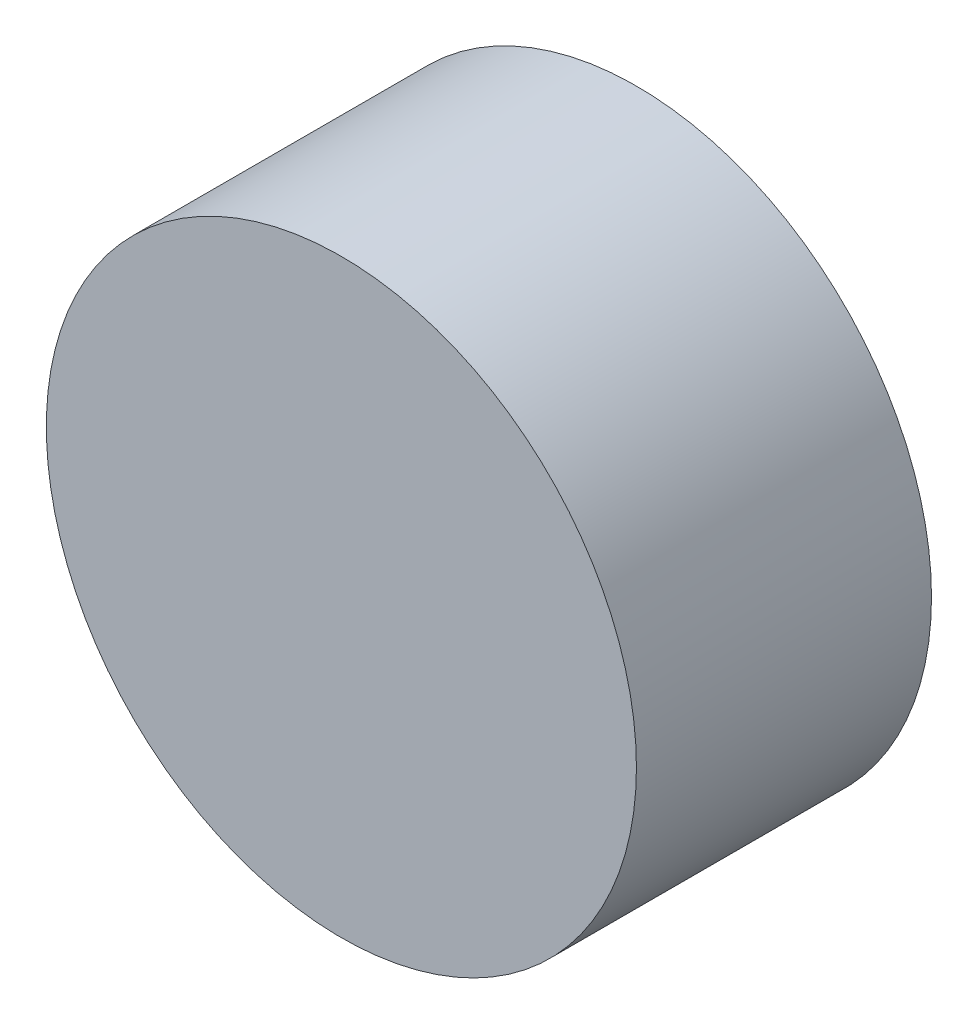
ISO-10303-21;
HEADER;
FILE_DESCRIPTION(('STEP AP214'),'2;1');
FILE_NAME('part.step','',(''),(''),'','','');
FILE_SCHEMA(('AUTOMOTIVE_DESIGN { 1 0 10303 214 1 1 1 1 }'));
ENDSEC;
DATA;
#1=APPLICATION_CONTEXT('core data for automotive mechanical design processes');
#2=APPLICATION_PROTOCOL_DEFINITION('international standard','automotive_design',2000,#1);
#3=PRODUCT_CONTEXT('',#1,'mechanical');
#4=PRODUCT('Part','Part','',(#3));
#5=PRODUCT_RELATED_PRODUCT_CATEGORY('part','',(#4));
#6=PRODUCT_DEFINITION_FORMATION('','',#4);
#7=PRODUCT_DEFINITION_CONTEXT('part definition',#1,'design');
#8=PRODUCT_DEFINITION('design','',#6,#7);
#9=PRODUCT_DEFINITION_SHAPE('','',#8);
#10=(LENGTH_UNIT() NAMED_UNIT(*) SI_UNIT(.MILLI.,.METRE.));
#11=(NAMED_UNIT(*) PLANE_ANGLE_UNIT() SI_UNIT($,.RADIAN.));
#12=(NAMED_UNIT(*) SI_UNIT($,.STERADIAN.) SOLID_ANGLE_UNIT());
#13=UNCERTAINTY_MEASURE_WITH_UNIT(LENGTH_MEASURE(1.E-05),#10,'distance_accuracy_value','');
#14=(GEOMETRIC_REPRESENTATION_CONTEXT(3) GLOBAL_UNCERTAINTY_ASSIGNED_CONTEXT((#13)) GLOBAL_UNIT_ASSIGNED_CONTEXT((#10,
#11,#12)) REPRESENTATION_CONTEXT('',''));
#15=CARTESIAN_POINT('',(0.,0.,0.));
#16=DIRECTION('',(0.,0.,1.));
#17=DIRECTION('',(1.,0.,0.));
#18=AXIS2_PLACEMENT_3D('',#15,#16,#17);
#19=CARTESIAN_POINT('',(0.,0.,100.));
#20=DIRECTION('',(0.,0.,-1.));
#21=DIRECTION('',(-1.,0.,0.));
#22=AXIS2_PLACEMENT_3D('',#19,#20,#21);
#23=CYLINDRICAL_SURFACE('',#22,100.);
#24=CARTESIAN_POINT('',(0.,0.,100.));
#25=DIRECTION('',(0.,0.,1.));
#26=DIRECTION('',(1.,0.,0.));
#27=AXIS2_PLACEMENT_3D('',#24,#25,#26);
#28=CIRCLE('',#27,100.);
#29=CARTESIAN_POINT('',(100.,0.,100.));
#30=VERTEX_POINT('',#29);
#31=EDGE_CURVE('E10',#30,#30,#28,.T.);
#32=ORIENTED_EDGE('',*,*,#31,.F.);
#33=EDGE_LOOP('',(#32));
#34=FACE_BOUND('',#33,.T.);
#35=CARTESIAN_POINT('',(0.,0.,0.));
#36=DIRECTION('',(0.,0.,1.));
#37=DIRECTION('',(1.,0.,0.));
#38=AXIS2_PLACEMENT_3D('',#35,#36,#37);
#39=CIRCLE('',#38,100.);
#40=CARTESIAN_POINT('',(100.,0.,0.));
#41=VERTEX_POINT('',#40);
#42=EDGE_CURVE('E40',#41,#41,#39,.T.);
#43=ORIENTED_EDGE('',*,*,#42,.T.);
#44=EDGE_LOOP('',(#43));
#45=FACE_BOUND('',#44,.T.);
#46=ADVANCED_FACE('F37',(#34,#45),#23,.T.);
#47=CARTESIAN_POINT('',(0.,0.,100.));
#48=DIRECTION('',(0.,0.,1.));
#49=DIRECTION('',(1.,0.,0.));
#50=AXIS2_PLACEMENT_3D('',#47,#48,#49);
#51=PLANE('',#50);
#52=ORIENTED_EDGE('',*,*,#31,.T.);
#53=EDGE_LOOP('',(#52));
#54=FACE_BOUND('',#53,.T.);
#55=ADVANCED_FACE('F54',(#54),#51,.T.);
#56=CARTESIAN_POINT('',(0.,0.,0.));
#57=DIRECTION('',(0.,0.,1.));
#58=DIRECTION('',(1.,0.,0.));
#59=AXIS2_PLACEMENT_3D('',#56,#57,#58);
#60=PLANE('',#59);
#61=ORIENTED_EDGE('',*,*,#42,.F.);
#62=EDGE_LOOP('',(#61));
#63=FACE_BOUND('',#62,.T.);
#64=ADVANCED_FACE('F52',(#63),#60,.F.);
#65=CLOSED_SHELL('',(#46,#55,#64));
#66=MANIFOLD_SOLID_BREP('B2',#65);
#67=ADVANCED_BREP_SHAPE_REPRESENTATION('',(#18,#66),#14);
#68=SHAPE_DEFINITION_REPRESENTATION(#9,#67);
ENDSEC;
END-ISO-10303-21;
